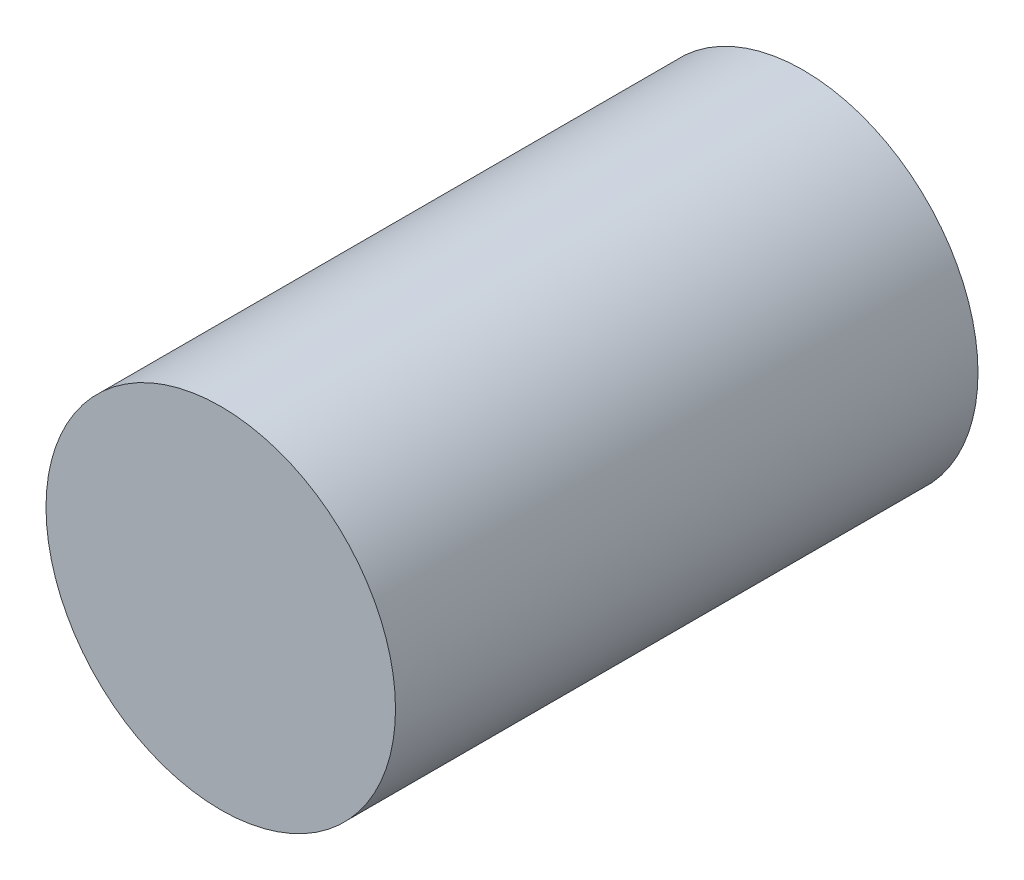
ISO-10303-21;
HEADER;
FILE_DESCRIPTION(('STEP AP214'),'2;1');
FILE_NAME('part.step','',(''),(''),'','','');
FILE_SCHEMA(('AUTOMOTIVE_DESIGN { 1 0 10303 214 1 1 1 1 }'));
ENDSEC;
DATA;
#1=APPLICATION_CONTEXT('core data for automotive mechanical design processes');
#2=APPLICATION_PROTOCOL_DEFINITION('international standard','automotive_design',2000,#1);
#3=PRODUCT_CONTEXT('',#1,'mechanical');
#4=PRODUCT('Part','Part','',(#3));
#5=PRODUCT_RELATED_PRODUCT_CATEGORY('part','',(#4));
#6=PRODUCT_DEFINITION_FORMATION('','',#4);
#7=PRODUCT_DEFINITION_CONTEXT('part definition',#1,'design');
#8=PRODUCT_DEFINITION('design','',#6,#7);
#9=PRODUCT_DEFINITION_SHAPE('','',#8);
#10=(LENGTH_UNIT() NAMED_UNIT(*) SI_UNIT(.MILLI.,.METRE.));
#11=(NAMED_UNIT(*) PLANE_ANGLE_UNIT() SI_UNIT($,.RADIAN.));
#12=(NAMED_UNIT(*) SI_UNIT($,.STERADIAN.) SOLID_ANGLE_UNIT());
#13=UNCERTAINTY_MEASURE_WITH_UNIT(LENGTH_MEASURE(1.E-05),#10,'distance_accuracy_value','');
#14=(GEOMETRIC_REPRESENTATION_CONTEXT(3) GLOBAL_UNCERTAINTY_ASSIGNED_CONTEXT((#13)) GLOBAL_UNIT_ASSIGNED_CONTEXT((#10,
#11,#12)) REPRESENTATION_CONTEXT('',''));
#15=CARTESIAN_POINT('',(0.,0.,0.));
#16=DIRECTION('',(0.,0.,1.));
#17=DIRECTION('',(1.,0.,0.));
#18=AXIS2_PLACEMENT_3D('',#15,#16,#17);
#19=CARTESIAN_POINT('',(181.071886603092,170.669160633111,-5.));
#20=DIRECTION('',(0.,0.,1.));
#21=DIRECTION('',(1.,0.,0.));
#22=AXIS2_PLACEMENT_3D('',#19,#20,#21);
#23=CYLINDRICAL_SURFACE('',#22,1.5);
#24=CARTESIAN_POINT('',(181.071886603092,170.669160633111,-5.));
#25=DIRECTION('',(0.,0.,1.));
#26=DIRECTION('',(1.,0.,0.));
#27=AXIS2_PLACEMENT_3D('',#24,#25,#26);
#28=CIRCLE('',#27,1.5);
#29=CARTESIAN_POINT('',(182.571886603092,170.669160633111,-5.));
#30=VERTEX_POINT('',#29);
#31=EDGE_CURVE('E10',#30,#30,#28,.T.);
#32=ORIENTED_EDGE('',*,*,#31,.T.);
#33=EDGE_LOOP('',(#32));
#34=FACE_BOUND('',#33,.T.);
#35=CARTESIAN_POINT('',(181.071886603092,170.669160633111,0.));
#36=DIRECTION('',(0.,0.,1.));
#37=DIRECTION('',(1.,0.,0.));
#38=AXIS2_PLACEMENT_3D('',#35,#36,#37);
#39=CIRCLE('',#38,1.5);
#40=CARTESIAN_POINT('',(182.571886603092,170.669160633111,0.));
#41=VERTEX_POINT('',#40);
#42=EDGE_CURVE('E40',#41,#41,#39,.T.);
#43=ORIENTED_EDGE('',*,*,#42,.F.);
#44=EDGE_LOOP('',(#43));
#45=FACE_BOUND('',#44,.T.);
#46=ADVANCED_FACE('F37',(#34,#45),#23,.T.);
#47=CARTESIAN_POINT('',(181.071886603092,170.669160633111,-5.));
#48=DIRECTION('',(0.,0.,1.));
#49=DIRECTION('',(1.,0.,0.));
#50=AXIS2_PLACEMENT_3D('',#47,#48,#49);
#51=PLANE('',#50);
#52=ORIENTED_EDGE('',*,*,#31,.F.);
#53=EDGE_LOOP('',(#52));
#54=FACE_BOUND('',#53,.T.);
#55=ADVANCED_FACE('F54',(#54),#51,.F.);
#56=CARTESIAN_POINT('',(181.071886603092,170.669160633111,0.));
#57=DIRECTION('',(0.,0.,1.));
#58=DIRECTION('',(1.,0.,0.));
#59=AXIS2_PLACEMENT_3D('',#56,#57,#58);
#60=PLANE('',#59);
#61=ORIENTED_EDGE('',*,*,#42,.T.);
#62=EDGE_LOOP('',(#61));
#63=FACE_BOUND('',#62,.T.);
#64=ADVANCED_FACE('F51',(#63),#60,.T.);
#65=CLOSED_SHELL('',(#46,#55,#64));
#66=MANIFOLD_SOLID_BREP('B2',#65);
#67=ADVANCED_BREP_SHAPE_REPRESENTATION('',(#18,#66),#14);
#68=SHAPE_DEFINITION_REPRESENTATION(#9,#67);
ENDSEC;
END-ISO-10303-21;
